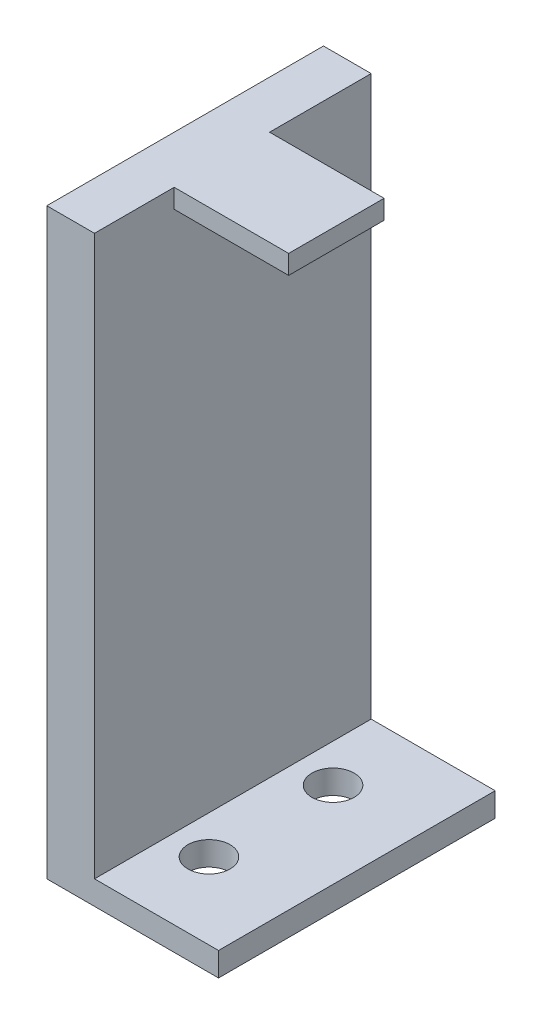
ISO-10303-21;
HEADER;
FILE_DESCRIPTION(('STEP AP214'),'2;1');
FILE_NAME('part.step','',(''),(''),'','','');
FILE_SCHEMA(('AUTOMOTIVE_DESIGN { 1 0 10303 214 1 1 1 1 }'));
ENDSEC;
DATA;
#1=APPLICATION_CONTEXT('core data for automotive mechanical design processes');
#2=APPLICATION_PROTOCOL_DEFINITION('international standard','automotive_design',2000,#1);
#3=PRODUCT_CONTEXT('',#1,'mechanical');
#4=PRODUCT('Part','Part','',(#3));
#5=PRODUCT_RELATED_PRODUCT_CATEGORY('part','',(#4));
#6=PRODUCT_DEFINITION_FORMATION('','',#4);
#7=PRODUCT_DEFINITION_CONTEXT('part definition',#1,'design');
#8=PRODUCT_DEFINITION('design','',#6,#7);
#9=PRODUCT_DEFINITION_SHAPE('','',#8);
#10=(LENGTH_UNIT() NAMED_UNIT(*) SI_UNIT(.MILLI.,.METRE.));
#11=(NAMED_UNIT(*) PLANE_ANGLE_UNIT() SI_UNIT($,.RADIAN.));
#12=(NAMED_UNIT(*) SI_UNIT($,.STERADIAN.) SOLID_ANGLE_UNIT());
#13=UNCERTAINTY_MEASURE_WITH_UNIT(LENGTH_MEASURE(1.E-05),#10,'distance_accuracy_value','');
#14=(GEOMETRIC_REPRESENTATION_CONTEXT(3) GLOBAL_UNCERTAINTY_ASSIGNED_CONTEXT((#13)) GLOBAL_UNIT_ASSIGNED_CONTEXT((#10,
#11,#12)) REPRESENTATION_CONTEXT('',''));
#15=CARTESIAN_POINT('',(0.,0.,0.));
#16=DIRECTION('',(0.,0.,1.));
#17=DIRECTION('',(1.,0.,0.));
#18=AXIS2_PLACEMENT_3D('',#15,#16,#17);
#19=CARTESIAN_POINT('',(-16.51,77.597,-36.83));
#20=DIRECTION('',(-1.,0.,0.));
#21=DIRECTION('',(0.,0.,1.));
#22=AXIS2_PLACEMENT_3D('',#19,#20,#21);
#23=PLANE('',#22);
#24=DIRECTION('',(0.,-1.,0.));
#25=VECTOR('',#24,1.);
#26=CARTESIAN_POINT('',(-16.51,77.597,-10.6065646393861));
#27=LINE('',#26,#25);
#28=CARTESIAN_POINT('',(-16.51,77.597,-10.6065646393861));
#29=VERTEX_POINT('',#28);
#30=CARTESIAN_POINT('',(-16.51,75.057,-10.6065646393861));
#31=VERTEX_POINT('',#30);
#32=EDGE_CURVE('E146',#29,#31,#27,.T.);
#33=ORIENTED_EDGE('',*,*,#32,.F.);
#34=DIRECTION('',(0.,0.,-1.));
#35=VECTOR('',#34,1.);
#36=CARTESIAN_POINT('',(-16.51,77.597,-36.83));
#37=LINE('',#36,#35);
#38=CARTESIAN_POINT('',(-16.51,77.597,0.));
#39=VERTEX_POINT('',#38);
#40=EDGE_CURVE('E160',#39,#29,#37,.T.);
#41=ORIENTED_EDGE('',*,*,#40,.F.);
#42=DIRECTION('',(0.,-1.,0.));
#43=VECTOR('',#42,1.);
#44=CARTESIAN_POINT('',(-16.51,77.597,0.));
#45=LINE('',#44,#43);
#46=CARTESIAN_POINT('',(-16.51,3.175,0.));
#47=VERTEX_POINT('',#46);
#48=EDGE_CURVE('E170',#39,#47,#45,.T.);
#49=ORIENTED_EDGE('',*,*,#48,.T.);
#50=DIRECTION('',(0.,0.,-1.));
#51=VECTOR('',#50,1.);
#52=CARTESIAN_POINT('',(-16.51,3.175,-36.83));
#53=LINE('',#52,#51);
#54=CARTESIAN_POINT('',(-16.51,3.175,-36.83));
#55=VERTEX_POINT('',#54);
#56=EDGE_CURVE('E66',#47,#55,#53,.T.);
#57=ORIENTED_EDGE('',*,*,#56,.T.);
#58=DIRECTION('',(0.,-1.,0.));
#59=VECTOR('',#58,1.);
#60=CARTESIAN_POINT('',(-16.51,77.597,-36.83));
#61=LINE('',#60,#59);
#62=CARTESIAN_POINT('',(-16.51,77.597,-36.83));
#63=VERTEX_POINT('',#62);
#64=EDGE_CURVE('E165',#63,#55,#61,.T.);
#65=ORIENTED_EDGE('',*,*,#64,.F.);
#66=CARTESIAN_POINT('',(-16.51,77.597,-23.3065646393861));
#67=VERTEX_POINT('',#66);
#68=EDGE_CURVE('E159',#67,#63,#37,.T.);
#69=ORIENTED_EDGE('',*,*,#68,.F.);
#70=DIRECTION('',(0.,1.,0.));
#71=VECTOR('',#70,1.);
#72=CARTESIAN_POINT('',(-16.51,77.597,-23.3065646393861));
#73=LINE('',#72,#71);
#74=CARTESIAN_POINT('',(-16.51,75.057,-23.3065646393861));
#75=VERTEX_POINT('',#74);
#76=EDGE_CURVE('E142',#75,#67,#73,.T.);
#77=ORIENTED_EDGE('',*,*,#76,.F.);
#78=DIRECTION('',(0.,0.,-1.));
#79=VECTOR('',#78,1.);
#80=CARTESIAN_POINT('',(-16.51,75.057,-10.6065646393861));
#81=LINE('',#80,#79);
#82=EDGE_CURVE('E228',#31,#75,#81,.T.);
#83=ORIENTED_EDGE('',*,*,#82,.F.);
#84=EDGE_LOOP('',(#33,#41,#49,#57,#65,#69,#77,#83));
#85=FACE_BOUND('',#84,.T.);
#86=ADVANCED_FACE('F42',(#85),#23,.F.);
#87=CARTESIAN_POINT('',(0.,3.175,0.));
#88=DIRECTION('',(-1.,0.,0.));
#89=DIRECTION('',(0.,0.,1.));
#90=AXIS2_PLACEMENT_3D('',#87,#88,#89);
#91=PLANE('',#90);
#92=DIRECTION('',(0.,0.,-1.));
#93=VECTOR('',#92,1.);
#94=CARTESIAN_POINT('',(0.,0.,0.));
#95=LINE('',#94,#93);
#96=CARTESIAN_POINT('',(0.,0.,0.));
#97=VERTEX_POINT('',#96);
#98=CARTESIAN_POINT('',(0.,0.,-36.83));
#99=VERTEX_POINT('',#98);
#100=EDGE_CURVE('E173',#97,#99,#95,.T.);
#101=ORIENTED_EDGE('',*,*,#100,.T.);
#102=DIRECTION('',(0.,-1.,0.));
#103=VECTOR('',#102,1.);
#104=CARTESIAN_POINT('',(0.,3.175,-36.83));
#105=LINE('',#104,#103);
#106=CARTESIAN_POINT('',(0.,3.175,-36.83));
#107=VERTEX_POINT('',#106);
#108=EDGE_CURVE('E11',#107,#99,#105,.T.);
#109=ORIENTED_EDGE('',*,*,#108,.F.);
#110=DIRECTION('',(0.,0.,-1.));
#111=VECTOR('',#110,1.);
#112=CARTESIAN_POINT('',(0.,3.175,0.));
#113=LINE('',#112,#111);
#114=CARTESIAN_POINT('',(0.,3.175,0.));
#115=VERTEX_POINT('',#114);
#116=EDGE_CURVE('E174',#115,#107,#113,.T.);
#117=ORIENTED_EDGE('',*,*,#116,.F.);
#118=DIRECTION('',(0.,-1.,0.));
#119=VECTOR('',#118,1.);
#120=CARTESIAN_POINT('',(0.,3.175,0.));
#121=LINE('',#120,#119);
#122=EDGE_CURVE('E184',#115,#97,#121,.T.);
#123=ORIENTED_EDGE('',*,*,#122,.T.);
#124=EDGE_LOOP('',(#101,#109,#117,#123));
#125=FACE_BOUND('',#124,.T.);
#126=ADVANCED_FACE('F44',(#125),#91,.F.);
#127=CARTESIAN_POINT('',(0.,3.175,-36.83));
#128=DIRECTION('',(0.,0.,1.));
#129=DIRECTION('',(1.,0.,0.));
#130=AXIS2_PLACEMENT_3D('',#127,#128,#129);
#131=PLANE('',#130);
#132=DIRECTION('',(-1.,0.,0.));
#133=VECTOR('',#132,1.);
#134=CARTESIAN_POINT('',(0.,0.,-36.83));
#135=LINE('',#134,#133);
#136=CARTESIAN_POINT('',(-22.86,0.,-36.83));
#137=VERTEX_POINT('',#136);
#138=EDGE_CURVE('E188',#99,#137,#135,.T.);
#139=ORIENTED_EDGE('',*,*,#138,.T.);
#140=DIRECTION('',(0.,-1.,0.));
#141=VECTOR('',#140,1.);
#142=CARTESIAN_POINT('',(-22.86,3.175,-36.83));
#143=LINE('',#142,#141);
#144=CARTESIAN_POINT('',(-22.86,77.597,-36.83));
#145=VERTEX_POINT('',#144);
#146=EDGE_CURVE('E51',#145,#137,#143,.T.);
#147=ORIENTED_EDGE('',*,*,#146,.F.);
#148=DIRECTION('',(-1.,0.,0.));
#149=VECTOR('',#148,1.);
#150=CARTESIAN_POINT('',(-22.86,77.597,-36.83));
#151=LINE('',#150,#149);
#152=EDGE_CURVE('E163',#63,#145,#151,.T.);
#153=ORIENTED_EDGE('',*,*,#152,.F.);
#154=ORIENTED_EDGE('',*,*,#64,.T.);
#155=DIRECTION('',(-1.,0.,0.));
#156=VECTOR('',#155,1.);
#157=CARTESIAN_POINT('',(0.,3.175,-36.83));
#158=LINE('',#157,#156);
#159=EDGE_CURVE('E178',#107,#55,#158,.T.);
#160=ORIENTED_EDGE('',*,*,#159,.F.);
#161=ORIENTED_EDGE('',*,*,#108,.T.);
#162=EDGE_LOOP('',(#139,#147,#153,#154,#160,#161));
#163=FACE_BOUND('',#162,.T.);
#164=ADVANCED_FACE('F226',(#163),#131,.F.);
#165=CARTESIAN_POINT('',(-22.86,3.175,0.));
#166=DIRECTION('',(1.,0.,0.));
#167=DIRECTION('',(0.,0.,-1.));
#168=AXIS2_PLACEMENT_3D('',#165,#166,#167);
#169=PLANE('',#168);
#170=DIRECTION('',(0.,0.,1.));
#171=VECTOR('',#170,1.);
#172=CARTESIAN_POINT('',(-22.86,0.,0.));
#173=LINE('',#172,#171);
#174=CARTESIAN_POINT('',(-22.86,0.,0.));
#175=VERTEX_POINT('',#174);
#176=EDGE_CURVE('E191',#137,#175,#173,.T.);
#177=ORIENTED_EDGE('',*,*,#176,.T.);
#178=DIRECTION('',(0.,-1.,0.));
#179=VECTOR('',#178,1.);
#180=CARTESIAN_POINT('',(-22.86,3.175,0.));
#181=LINE('',#180,#179);
#182=CARTESIAN_POINT('',(-22.86,77.597,0.));
#183=VERTEX_POINT('',#182);
#184=EDGE_CURVE('E197',#183,#175,#181,.T.);
#185=ORIENTED_EDGE('',*,*,#184,.F.);
#186=DIRECTION('',(0.,0.,1.));
#187=VECTOR('',#186,1.);
#188=CARTESIAN_POINT('',(-22.86,77.597,-36.83));
#189=LINE('',#188,#187);
#190=EDGE_CURVE('E150',#145,#183,#189,.T.);
#191=ORIENTED_EDGE('',*,*,#190,.F.);
#192=ORIENTED_EDGE('',*,*,#146,.T.);
#193=EDGE_LOOP('',(#177,#185,#191,#192));
#194=FACE_BOUND('',#193,.T.);
#195=ADVANCED_FACE('F204',(#194),#169,.F.);
#196=CARTESIAN_POINT('',(0.,3.175,0.));
#197=DIRECTION('',(0.,0.,-1.));
#198=DIRECTION('',(-1.,0.,0.));
#199=AXIS2_PLACEMENT_3D('',#196,#197,#198);
#200=PLANE('',#199);
#201=DIRECTION('',(1.,0.,0.));
#202=VECTOR('',#201,1.);
#203=CARTESIAN_POINT('',(0.,0.,0.));
#204=LINE('',#203,#202);
#205=EDGE_CURVE('E179',#175,#97,#204,.T.);
#206=ORIENTED_EDGE('',*,*,#205,.T.);
#207=ORIENTED_EDGE('',*,*,#122,.F.);
#208=DIRECTION('',(1.,0.,0.));
#209=VECTOR('',#208,1.);
#210=CARTESIAN_POINT('',(0.,3.175,0.));
#211=LINE('',#210,#209);
#212=EDGE_CURVE('E182',#47,#115,#211,.T.);
#213=ORIENTED_EDGE('',*,*,#212,.F.);
#214=ORIENTED_EDGE('',*,*,#48,.F.);
#215=DIRECTION('',(1.,0.,0.));
#216=VECTOR('',#215,1.);
#217=CARTESIAN_POINT('',(-22.86,77.597,0.));
#218=LINE('',#217,#216);
#219=EDGE_CURVE('E157',#183,#39,#218,.T.);
#220=ORIENTED_EDGE('',*,*,#219,.F.);
#221=ORIENTED_EDGE('',*,*,#184,.T.);
#222=EDGE_LOOP('',(#206,#207,#213,#214,#220,#221));
#223=FACE_BOUND('',#222,.T.);
#224=ADVANCED_FACE('F213',(#223),#200,.F.);
#225=CARTESIAN_POINT('',(0.,3.175,0.));
#226=DIRECTION('',(0.,1.,0.));
#227=DIRECTION('',(0.,0.,1.));
#228=AXIS2_PLACEMENT_3D('',#225,#226,#227);
#229=PLANE('',#228);
#230=CARTESIAN_POINT('',(-11.43,3.175,-26.67));
#231=DIRECTION('',(0.,1.,0.));
#232=DIRECTION('',(0.,0.,1.));
#233=AXIS2_PLACEMENT_3D('',#230,#231,#232);
#234=CIRCLE('',#233,2.80669999999999);
#235=CARTESIAN_POINT('',(-11.43,3.175,-23.8633));
#236=VERTEX_POINT('',#235);
#237=EDGE_CURVE('E243',#236,#236,#234,.T.);
#238=ORIENTED_EDGE('',*,*,#237,.F.);
#239=EDGE_LOOP('',(#238));
#240=FACE_BOUND('',#239,.T.);
#241=CARTESIAN_POINT('',(-11.43,3.175,-10.16));
#242=DIRECTION('',(0.,1.,0.));
#243=DIRECTION('',(0.,0.,1.));
#244=AXIS2_PLACEMENT_3D('',#241,#242,#243);
#245=CIRCLE('',#244,2.80669999999999);
#246=CARTESIAN_POINT('',(-11.43,3.175,-7.35330000000001));
#247=VERTEX_POINT('',#246);
#248=EDGE_CURVE('E236',#247,#247,#245,.T.);
#249=ORIENTED_EDGE('',*,*,#248,.F.);
#250=EDGE_LOOP('',(#249));
#251=FACE_BOUND('',#250,.T.);
#252=ORIENTED_EDGE('',*,*,#56,.F.);
#253=ORIENTED_EDGE('',*,*,#212,.T.);
#254=ORIENTED_EDGE('',*,*,#116,.T.);
#255=ORIENTED_EDGE('',*,*,#159,.T.);
#256=EDGE_LOOP('',(#252,#253,#254,#255));
#257=FACE_BOUND('',#256,.T.);
#258=ADVANCED_FACE('F218',(#240,#251,#257),#229,.T.);
#259=CARTESIAN_POINT('',(0.,0.,0.));
#260=DIRECTION('',(0.,1.,0.));
#261=DIRECTION('',(0.,0.,1.));
#262=AXIS2_PLACEMENT_3D('',#259,#260,#261);
#263=PLANE('',#262);
#264=CARTESIAN_POINT('',(-11.43,0.,-26.67));
#265=DIRECTION('',(0.,-1.,0.));
#266=DIRECTION('',(0.,0.,-1.));
#267=AXIS2_PLACEMENT_3D('',#264,#265,#266);
#268=CIRCLE('',#267,2.80669999999999);
#269=CARTESIAN_POINT('',(-11.43,0.,-29.4767));
#270=VERTEX_POINT('',#269);
#271=EDGE_CURVE('E249',#270,#270,#268,.T.);
#272=ORIENTED_EDGE('',*,*,#271,.F.);
#273=EDGE_LOOP('',(#272));
#274=FACE_BOUND('',#273,.T.);
#275=CARTESIAN_POINT('',(-11.43,0.,-10.16));
#276=DIRECTION('',(0.,-1.,0.));
#277=DIRECTION('',(0.,0.,-1.));
#278=AXIS2_PLACEMENT_3D('',#275,#276,#277);
#279=CIRCLE('',#278,2.80669999999999);
#280=CARTESIAN_POINT('',(-11.43,0.,-12.9667));
#281=VERTEX_POINT('',#280);
#282=EDGE_CURVE('E238',#281,#281,#279,.T.);
#283=ORIENTED_EDGE('',*,*,#282,.F.);
#284=EDGE_LOOP('',(#283));
#285=FACE_BOUND('',#284,.T.);
#286=ORIENTED_EDGE('',*,*,#100,.F.);
#287=ORIENTED_EDGE('',*,*,#205,.F.);
#288=ORIENTED_EDGE('',*,*,#176,.F.);
#289=ORIENTED_EDGE('',*,*,#138,.F.);
#290=EDGE_LOOP('',(#286,#287,#288,#289));
#291=FACE_BOUND('',#290,.T.);
#292=ADVANCED_FACE('F210',(#274,#285,#291),#263,.F.);
#293=CARTESIAN_POINT('',(0.,77.597,0.));
#294=DIRECTION('',(0.,1.,0.));
#295=DIRECTION('',(0.,0.,1.));
#296=AXIS2_PLACEMENT_3D('',#293,#294,#295);
#297=PLANE('',#296);
#298=ORIENTED_EDGE('',*,*,#190,.T.);
#299=ORIENTED_EDGE('',*,*,#219,.T.);
#300=ORIENTED_EDGE('',*,*,#40,.T.);
#301=DIRECTION('',(-1.,0.,0.));
#302=VECTOR('',#301,1.);
#303=CARTESIAN_POINT('',(-1.26999999999999,77.597,-10.6065646393861));
#304=LINE('',#303,#302);
#305=CARTESIAN_POINT('',(-1.26999999999999,77.597,-10.6065646393861));
#306=VERTEX_POINT('',#305);
#307=EDGE_CURVE('E224',#306,#29,#304,.T.);
#308=ORIENTED_EDGE('',*,*,#307,.F.);
#309=DIRECTION('',(0.,0.,1.));
#310=VECTOR('',#309,1.);
#311=CARTESIAN_POINT('',(-1.26999999999999,77.597,-10.6065646393861));
#312=LINE('',#311,#310);
#313=CARTESIAN_POINT('',(-1.26999999999999,77.597,-23.3065646393861));
#314=VERTEX_POINT('',#313);
#315=EDGE_CURVE('E139',#314,#306,#312,.T.);
#316=ORIENTED_EDGE('',*,*,#315,.F.);
#317=DIRECTION('',(-1.,0.,0.));
#318=VECTOR('',#317,1.);
#319=CARTESIAN_POINT('',(-1.26999999999999,77.597,-23.3065646393861));
#320=LINE('',#319,#318);
#321=EDGE_CURVE('E58',#314,#67,#320,.T.);
#322=ORIENTED_EDGE('',*,*,#321,.T.);
#323=ORIENTED_EDGE('',*,*,#68,.T.);
#324=ORIENTED_EDGE('',*,*,#152,.T.);
#325=EDGE_LOOP('',(#298,#299,#300,#308,#316,#322,#323,#324));
#326=FACE_BOUND('',#325,.T.);
#327=ADVANCED_FACE('F223',(#326),#297,.T.);
#328=CARTESIAN_POINT('',(-1.26999999999999,77.597,-10.6065646393861));
#329=DIRECTION('',(0.,0.,-1.));
#330=DIRECTION('',(-1.,0.,0.));
#331=AXIS2_PLACEMENT_3D('',#328,#329,#330);
#332=PLANE('',#331);
#333=ORIENTED_EDGE('',*,*,#32,.T.);
#334=DIRECTION('',(-1.,0.,0.));
#335=VECTOR('',#334,1.);
#336=CARTESIAN_POINT('',(-1.26999999999999,75.057,-10.6065646393861));
#337=LINE('',#336,#335);
#338=CARTESIAN_POINT('',(-1.26999999999999,75.057,-10.6065646393861));
#339=VERTEX_POINT('',#338);
#340=EDGE_CURVE('E128',#339,#31,#337,.T.);
#341=ORIENTED_EDGE('',*,*,#340,.F.);
#342=DIRECTION('',(0.,-1.,0.));
#343=VECTOR('',#342,1.);
#344=CARTESIAN_POINT('',(-1.26999999999999,77.597,-10.6065646393861));
#345=LINE('',#344,#343);
#346=EDGE_CURVE('E135',#306,#339,#345,.T.);
#347=ORIENTED_EDGE('',*,*,#346,.F.);
#348=ORIENTED_EDGE('',*,*,#307,.T.);
#349=EDGE_LOOP('',(#333,#341,#347,#348));
#350=FACE_BOUND('',#349,.T.);
#351=ADVANCED_FACE('F144',(#350),#332,.F.);
#352=CARTESIAN_POINT('',(-1.26999999999999,75.057,-10.6065646393861));
#353=DIRECTION('',(0.,1.,0.));
#354=DIRECTION('',(0.,0.,1.));
#355=AXIS2_PLACEMENT_3D('',#352,#353,#354);
#356=PLANE('',#355);
#357=ORIENTED_EDGE('',*,*,#82,.T.);
#358=DIRECTION('',(-1.,0.,0.));
#359=VECTOR('',#358,1.);
#360=CARTESIAN_POINT('',(-1.26999999999999,75.057,-23.3065646393861));
#361=LINE('',#360,#359);
#362=CARTESIAN_POINT('',(-1.26999999999999,75.057,-23.3065646393861));
#363=VERTEX_POINT('',#362);
#364=EDGE_CURVE('E131',#363,#75,#361,.T.);
#365=ORIENTED_EDGE('',*,*,#364,.F.);
#366=DIRECTION('',(0.,0.,-1.));
#367=VECTOR('',#366,1.);
#368=CARTESIAN_POINT('',(-1.26999999999999,75.057,-10.6065646393861));
#369=LINE('',#368,#367);
#370=EDGE_CURVE('E124',#339,#363,#369,.T.);
#371=ORIENTED_EDGE('',*,*,#370,.F.);
#372=ORIENTED_EDGE('',*,*,#340,.T.);
#373=EDGE_LOOP('',(#357,#365,#371,#372));
#374=FACE_BOUND('',#373,.T.);
#375=ADVANCED_FACE('F126',(#374),#356,.F.);
#376=CARTESIAN_POINT('',(-1.26999999999999,77.597,-23.3065646393861));
#377=DIRECTION('',(0.,0.,1.));
#378=DIRECTION('',(1.,0.,0.));
#379=AXIS2_PLACEMENT_3D('',#376,#377,#378);
#380=PLANE('',#379);
#381=ORIENTED_EDGE('',*,*,#76,.T.);
#382=ORIENTED_EDGE('',*,*,#321,.F.);
#383=DIRECTION('',(0.,1.,0.));
#384=VECTOR('',#383,1.);
#385=CARTESIAN_POINT('',(-1.26999999999999,77.597,-23.3065646393861));
#386=LINE('',#385,#384);
#387=EDGE_CURVE('E134',#363,#314,#386,.T.);
#388=ORIENTED_EDGE('',*,*,#387,.F.);
#389=ORIENTED_EDGE('',*,*,#364,.T.);
#390=EDGE_LOOP('',(#381,#382,#388,#389));
#391=FACE_BOUND('',#390,.T.);
#392=ADVANCED_FACE('F270',(#391),#380,.F.);
#393=CARTESIAN_POINT('',(-1.26999999999999,0.,0.));
#394=DIRECTION('',(1.,0.,0.));
#395=DIRECTION('',(0.,0.,-1.));
#396=AXIS2_PLACEMENT_3D('',#393,#394,#395);
#397=PLANE('',#396);
#398=ORIENTED_EDGE('',*,*,#346,.T.);
#399=ORIENTED_EDGE('',*,*,#370,.T.);
#400=ORIENTED_EDGE('',*,*,#387,.T.);
#401=ORIENTED_EDGE('',*,*,#315,.T.);
#402=EDGE_LOOP('',(#398,#399,#400,#401));
#403=FACE_BOUND('',#402,.T.);
#404=ADVANCED_FACE('F138',(#403),#397,.T.);
#405=CARTESIAN_POINT('',(-11.43,0.,-10.16));
#406=DIRECTION('',(0.,-1.,0.));
#407=DIRECTION('',(0.,0.,-1.));
#408=AXIS2_PLACEMENT_3D('',#405,#406,#407);
#409=CYLINDRICAL_SURFACE('',#408,2.80669999999999);
#410=ORIENTED_EDGE('',*,*,#282,.T.);
#411=EDGE_LOOP('',(#410));
#412=FACE_BOUND('',#411,.T.);
#413=ORIENTED_EDGE('',*,*,#248,.T.);
#414=EDGE_LOOP('',(#413));
#415=FACE_BOUND('',#414,.T.);
#416=ADVANCED_FACE('F262',(#412,#415),#409,.F.);
#417=CARTESIAN_POINT('',(-11.43,0.,-26.67));
#418=DIRECTION('',(0.,-1.,0.));
#419=DIRECTION('',(0.,0.,-1.));
#420=AXIS2_PLACEMENT_3D('',#417,#418,#419);
#421=CYLINDRICAL_SURFACE('',#420,2.80669999999999);
#422=ORIENTED_EDGE('',*,*,#271,.T.);
#423=EDGE_LOOP('',(#422));
#424=FACE_BOUND('',#423,.T.);
#425=ORIENTED_EDGE('',*,*,#237,.T.);
#426=EDGE_LOOP('',(#425));
#427=FACE_BOUND('',#426,.T.);
#428=ADVANCED_FACE('F254',(#424,#427),#421,.F.);
#429=CLOSED_SHELL('',(#86,#126,#164,#195,#224,#258,#292,#327,#351,#375,#392,#404,#416,#428));
#430=MANIFOLD_SOLID_BREP('B2',#429);
#431=ADVANCED_BREP_SHAPE_REPRESENTATION('',(#18,#430),#14);
#432=SHAPE_DEFINITION_REPRESENTATION(#9,#431);
ENDSEC;
END-ISO-10303-21;
